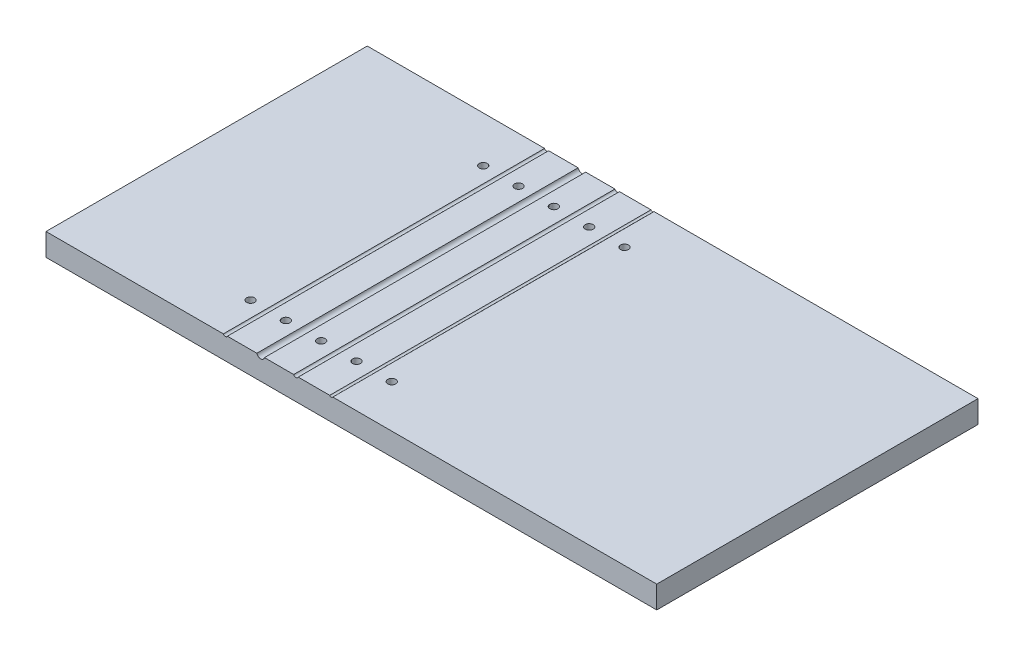
ISO-10303-21;
HEADER;
FILE_DESCRIPTION(('STEP AP214'),'2;1');
FILE_NAME('part.step','',(''),(''),'','','');
FILE_SCHEMA(('AUTOMOTIVE_DESIGN { 1 0 10303 214 1 1 1 1 }'));
ENDSEC;
DATA;
#1=APPLICATION_CONTEXT('core data for automotive mechanical design processes');
#2=APPLICATION_PROTOCOL_DEFINITION('international standard','automotive_design',2000,#1);
#3=PRODUCT_CONTEXT('',#1,'mechanical');
#4=PRODUCT('Part','Part','',(#3));
#5=PRODUCT_RELATED_PRODUCT_CATEGORY('part','',(#4));
#6=PRODUCT_DEFINITION_FORMATION('','',#4);
#7=PRODUCT_DEFINITION_CONTEXT('part definition',#1,'design');
#8=PRODUCT_DEFINITION('design','',#6,#7);
#9=PRODUCT_DEFINITION_SHAPE('','',#8);
#10=(LENGTH_UNIT() NAMED_UNIT(*) SI_UNIT(.MILLI.,.METRE.));
#11=(NAMED_UNIT(*) PLANE_ANGLE_UNIT() SI_UNIT($,.RADIAN.));
#12=(NAMED_UNIT(*) SI_UNIT($,.STERADIAN.) SOLID_ANGLE_UNIT());
#13=UNCERTAINTY_MEASURE_WITH_UNIT(LENGTH_MEASURE(1.E-05),#10,'distance_accuracy_value','');
#14=(GEOMETRIC_REPRESENTATION_CONTEXT(3) GLOBAL_UNCERTAINTY_ASSIGNED_CONTEXT((#13)) GLOBAL_UNIT_ASSIGNED_CONTEXT((#10,
#11,#12)) REPRESENTATION_CONTEXT('',''));
#15=CARTESIAN_POINT('',(0.,0.,0.));
#16=DIRECTION('',(0.,0.,1.));
#17=DIRECTION('',(1.,0.,0.));
#18=AXIS2_PLACEMENT_3D('',#15,#16,#17);
#19=CARTESIAN_POINT('',(0.,6.35,0.));
#20=DIRECTION('',(0.,1.,0.));
#21=DIRECTION('',(0.,0.,1.));
#22=AXIS2_PLACEMENT_3D('',#19,#20,#21);
#23=PLANE('',#22);
#24=CARTESIAN_POINT('',(69.420618556701,6.35,-72.4912460309142));
#25=DIRECTION('',(0.,1.,0.));
#26=DIRECTION('',(0.,0.,1.));
#27=AXIS2_PLACEMENT_3D('',#24,#25,#26);
#28=CIRCLE('',#27,1.1303);
#29=CARTESIAN_POINT('',(69.420618556701,6.35,-71.3609460309142));
#30=VERTEX_POINT('',#29);
#31=EDGE_CURVE('E303',#30,#30,#28,.T.);
#32=ORIENTED_EDGE('',*,*,#31,.F.);
#33=EDGE_LOOP('',(#32));
#34=FACE_BOUND('',#33,.T.);
#35=CARTESIAN_POINT('',(69.420618556701,6.35,-6.57431660018482));
#36=DIRECTION('',(0.,1.,0.));
#37=DIRECTION('',(0.,0.,1.));
#38=AXIS2_PLACEMENT_3D('',#35,#36,#37);
#39=CIRCLE('',#38,1.1303);
#40=CARTESIAN_POINT('',(69.420618556701,6.35,-5.44401660018481));
#41=VERTEX_POINT('',#40);
#42=EDGE_CURVE('E315',#41,#41,#39,.T.);
#43=ORIENTED_EDGE('',*,*,#42,.F.);
#44=EDGE_LOOP('',(#43));
#45=FACE_BOUND('',#44,.T.);
#46=DIRECTION('',(0.,0.,1.));
#47=VECTOR('',#46,1.);
#48=CARTESIAN_POINT('',(73.9876058548088,6.35,-85.433676975945));
#49=LINE('',#48,#47);
#50=CARTESIAN_POINT('',(73.9876058548088,6.35,-85.433676975945));
#51=VERTEX_POINT('',#50);
#52=CARTESIAN_POINT('',(73.9876058548088,6.35,5.56632302405498));
#53=VERTEX_POINT('',#52);
#54=EDGE_CURVE('E11',#51,#53,#49,.T.);
#55=ORIENTED_EDGE('',*,*,#54,.F.);
#56=DIRECTION('',(-1.,0.,0.));
#57=VECTOR('',#56,1.);
#58=CARTESIAN_POINT('',(-6.37938144329898,6.35,-85.433676975945));
#59=LINE('',#58,#57);
#60=CARTESIAN_POINT('',(65.0592277016402,6.35,-85.433676975945));
#61=VERTEX_POINT('',#60);
#62=EDGE_CURVE('E155',#51,#61,#59,.T.);
#63=ORIENTED_EDGE('',*,*,#62,.T.);
#64=DIRECTION('',(0.,0.,1.));
#65=VECTOR('',#64,1.);
#66=CARTESIAN_POINT('',(65.0592277016402,6.35,-85.433676975945));
#67=LINE('',#66,#65);
#68=CARTESIAN_POINT('',(65.0592277016402,6.35,5.56632302405498));
#69=VERTEX_POINT('',#68);
#70=EDGE_CURVE('E137',#69,#61,#67,.F.);
#71=ORIENTED_EDGE('',*,*,#70,.F.);
#72=DIRECTION('',(1.,0.,0.));
#73=VECTOR('',#72,1.);
#74=CARTESIAN_POINT('',(-6.37938144329897,6.35,5.56632302405498));
#75=LINE('',#74,#73);
#76=EDGE_CURVE('E132',#69,#53,#75,.T.);
#77=ORIENTED_EDGE('',*,*,#76,.T.);
#78=EDGE_LOOP('',(#55,#63,#71,#77));
#79=FACE_BOUND('',#78,.T.);
#80=ADVANCED_FACE('F35',(#34,#45,#79),#23,.T.);
#81=CARTESIAN_POINT('',(59.420618556701,6.35,-72.4912460309142));
#82=DIRECTION('',(0.,1.,0.));
#83=DIRECTION('',(0.,0.,1.));
#84=AXIS2_PLACEMENT_3D('',#81,#82,#83);
#85=CIRCLE('',#84,1.1303);
#86=CARTESIAN_POINT('',(59.420618556701,6.35,-71.3609460309142));
#87=VERTEX_POINT('',#86);
#88=EDGE_CURVE('E533',#87,#87,#85,.T.);
#89=ORIENTED_EDGE('',*,*,#88,.F.);
#90=EDGE_LOOP('',(#89));
#91=FACE_BOUND('',#90,.T.);
#92=CARTESIAN_POINT('',(59.420618556701,6.35,-6.57431660018482));
#93=DIRECTION('',(0.,1.,0.));
#94=DIRECTION('',(0.,0.,1.));
#95=AXIS2_PLACEMENT_3D('',#92,#93,#94);
#96=CIRCLE('',#95,1.1303);
#97=CARTESIAN_POINT('',(59.420618556701,6.35,-5.44401660018482));
#98=VERTEX_POINT('',#97);
#99=EDGE_CURVE('E291',#98,#98,#96,.T.);
#100=ORIENTED_EDGE('',*,*,#99,.F.);
#101=EDGE_LOOP('',(#100));
#102=FACE_BOUND('',#101,.T.);
#103=DIRECTION('',(0.,0.,1.));
#104=VECTOR('',#103,1.);
#105=CARTESIAN_POINT('',(63.7820094117618,6.35,-85.433676975945));
#106=LINE('',#105,#104);
#107=CARTESIAN_POINT('',(63.7820094117618,6.35,-85.433676975945));
#108=VERTEX_POINT('',#107);
#109=CARTESIAN_POINT('',(63.7820094117618,6.35,5.56632302405498));
#110=VERTEX_POINT('',#109);
#111=EDGE_CURVE('E188',#108,#110,#106,.T.);
#112=ORIENTED_EDGE('',*,*,#111,.F.);
#113=CARTESIAN_POINT('',(55.4918328209825,6.35,-85.433676975945));
#114=VERTEX_POINT('',#113);
#115=EDGE_CURVE('E216',#108,#114,#59,.T.);
#116=ORIENTED_EDGE('',*,*,#115,.T.);
#117=DIRECTION('',(0.,0.,1.));
#118=VECTOR('',#117,1.);
#119=CARTESIAN_POINT('',(55.4918328209825,6.35,-85.433676975945));
#120=LINE('',#119,#118);
#121=CARTESIAN_POINT('',(55.4918328209825,6.35,5.56632302405498));
#122=VERTEX_POINT('',#121);
#123=EDGE_CURVE('E182',#122,#114,#120,.F.);
#124=ORIENTED_EDGE('',*,*,#123,.F.);
#125=EDGE_CURVE('E138',#122,#110,#75,.T.);
#126=ORIENTED_EDGE('',*,*,#125,.T.);
#127=EDGE_LOOP('',(#112,#116,#124,#126));
#128=FACE_BOUND('',#127,.T.);
#129=ADVANCED_FACE('F245',(#91,#102,#128),#23,.T.);
#130=CARTESIAN_POINT('',(49.420618556701,6.35,-72.4912460309142));
#131=DIRECTION('',(0.,1.,0.));
#132=DIRECTION('',(0.,0.,1.));
#133=AXIS2_PLACEMENT_3D('',#130,#131,#132);
#134=CIRCLE('',#133,1.1303);
#135=CARTESIAN_POINT('',(49.420618556701,6.35,-71.3609460309142));
#136=VERTEX_POINT('',#135);
#137=EDGE_CURVE('E541',#136,#136,#134,.T.);
#138=ORIENTED_EDGE('',*,*,#137,.F.);
#139=EDGE_LOOP('',(#138));
#140=FACE_BOUND('',#139,.T.);
#141=CARTESIAN_POINT('',(49.420618556701,6.35,-6.57431660018482));
#142=DIRECTION('',(0.,1.,0.));
#143=DIRECTION('',(0.,0.,1.));
#144=AXIS2_PLACEMENT_3D('',#141,#142,#143);
#145=CIRCLE('',#144,1.1303);
#146=CARTESIAN_POINT('',(49.420618556701,6.35,-5.44401660018481));
#147=VERTEX_POINT('',#146);
#148=EDGE_CURVE('E294',#147,#147,#145,.T.);
#149=ORIENTED_EDGE('',*,*,#148,.F.);
#150=EDGE_LOOP('',(#149));
#151=FACE_BOUND('',#150,.T.);
#152=DIRECTION('',(0.,0.,1.));
#153=VECTOR('',#152,1.);
#154=CARTESIAN_POINT('',(53.3494042924196,6.35,-85.433676975945));
#155=LINE('',#154,#153);
#156=CARTESIAN_POINT('',(53.3494042924196,6.35,-85.433676975945));
#157=VERTEX_POINT('',#156);
#158=CARTESIAN_POINT('',(53.3494042924196,6.35,5.56632302405498));
#159=VERTEX_POINT('',#158);
#160=EDGE_CURVE('E185',#157,#159,#155,.T.);
#161=ORIENTED_EDGE('',*,*,#160,.F.);
#162=CARTESIAN_POINT('',(44.9904933587409,6.35,-85.433676975945));
#163=VERTEX_POINT('',#162);
#164=EDGE_CURVE('E215',#157,#163,#59,.T.);
#165=ORIENTED_EDGE('',*,*,#164,.T.);
#166=DIRECTION('',(0.,0.,1.));
#167=VECTOR('',#166,1.);
#168=CARTESIAN_POINT('',(44.9904933587409,6.35,-85.433676975945));
#169=LINE('',#168,#167);
#170=CARTESIAN_POINT('',(44.9904933587409,6.35,5.56632302405498));
#171=VERTEX_POINT('',#170);
#172=EDGE_CURVE('E177',#171,#163,#169,.F.);
#173=ORIENTED_EDGE('',*,*,#172,.F.);
#174=EDGE_CURVE('E141',#171,#159,#75,.T.);
#175=ORIENTED_EDGE('',*,*,#174,.T.);
#176=EDGE_LOOP('',(#161,#165,#173,#175));
#177=FACE_BOUND('',#176,.T.);
#178=ADVANCED_FACE('F240',(#140,#151,#177),#23,.T.);
#179=CARTESIAN_POINT('',(39.420618556701,6.35,-72.4912460309142));
#180=DIRECTION('',(0.,1.,0.));
#181=DIRECTION('',(0.,0.,1.));
#182=AXIS2_PLACEMENT_3D('',#179,#180,#181);
#183=CIRCLE('',#182,1.1303);
#184=CARTESIAN_POINT('',(39.420618556701,6.35,-71.3609460309142));
#185=VERTEX_POINT('',#184);
#186=EDGE_CURVE('E282',#185,#185,#183,.T.);
#187=ORIENTED_EDGE('',*,*,#186,.F.);
#188=EDGE_LOOP('',(#187));
#189=FACE_BOUND('',#188,.T.);
#190=CARTESIAN_POINT('',(39.420618556701,6.35,-6.57431660018482));
#191=DIRECTION('',(0.,1.,0.));
#192=DIRECTION('',(0.,0.,1.));
#193=AXIS2_PLACEMENT_3D('',#190,#191,#192);
#194=CIRCLE('',#193,1.1303);
#195=CARTESIAN_POINT('',(39.420618556701,6.35,-5.44401660018481));
#196=VERTEX_POINT('',#195);
#197=EDGE_CURVE('E285',#196,#196,#194,.T.);
#198=ORIENTED_EDGE('',*,*,#197,.F.);
#199=EDGE_LOOP('',(#198));
#200=FACE_BOUND('',#199,.T.);
#201=DIRECTION('',(0.,0.,1.));
#202=VECTOR('',#201,1.);
#203=CARTESIAN_POINT('',(43.8507437546611,6.35,-85.433676975945));
#204=LINE('',#203,#202);
#205=CARTESIAN_POINT('',(43.8507437546611,6.35,-85.433676975945));
#206=VERTEX_POINT('',#205);
#207=CARTESIAN_POINT('',(43.8507437546611,6.35,5.56632302405498));
#208=VERTEX_POINT('',#207);
#209=EDGE_CURVE('E180',#206,#208,#204,.T.);
#210=ORIENTED_EDGE('',*,*,#209,.F.);
#211=CARTESIAN_POINT('',(-6.37938144329898,6.35,-85.433676975945));
#212=VERTEX_POINT('',#211);
#213=EDGE_CURVE('E150',#206,#212,#59,.T.);
#214=ORIENTED_EDGE('',*,*,#213,.T.);
#215=DIRECTION('',(0.,0.,1.));
#216=VECTOR('',#215,1.);
#217=CARTESIAN_POINT('',(-6.37938144329898,6.35,-85.433676975945));
#218=LINE('',#217,#216);
#219=CARTESIAN_POINT('',(-6.37938144329897,6.35,5.56632302405498));
#220=VERTEX_POINT('',#219);
#221=EDGE_CURVE('E142',#212,#220,#218,.T.);
#222=ORIENTED_EDGE('',*,*,#221,.T.);
#223=EDGE_CURVE('E143',#220,#208,#75,.T.);
#224=ORIENTED_EDGE('',*,*,#223,.T.);
#225=EDGE_LOOP('',(#210,#214,#222,#224));
#226=FACE_BOUND('',#225,.T.);
#227=ADVANCED_FACE('F253',(#189,#200,#226),#23,.T.);
#228=CARTESIAN_POINT('',(-6.37938144329898,6.35,-85.433676975945));
#229=DIRECTION('',(1.,0.,0.));
#230=DIRECTION('',(0.,0.,-1.));
#231=AXIS2_PLACEMENT_3D('',#228,#229,#230);
#232=PLANE('',#231);
#233=DIRECTION('',(0.,0.,1.));
#234=VECTOR('',#233,1.);
#235=CARTESIAN_POINT('',(-6.37938144329898,0.,-85.433676975945));
#236=LINE('',#235,#234);
#237=CARTESIAN_POINT('',(-6.37938144329898,0.,-85.433676975945));
#238=VERTEX_POINT('',#237);
#239=CARTESIAN_POINT('',(-6.37938144329897,0.,5.56632302405498));
#240=VERTEX_POINT('',#239);
#241=EDGE_CURVE('E156',#238,#240,#236,.T.);
#242=ORIENTED_EDGE('',*,*,#241,.T.);
#243=DIRECTION('',(0.,-1.,0.));
#244=VECTOR('',#243,1.);
#245=CARTESIAN_POINT('',(-6.37938144329897,6.35,5.56632302405498));
#246=LINE('',#245,#244);
#247=EDGE_CURVE('E174',#220,#240,#246,.T.);
#248=ORIENTED_EDGE('',*,*,#247,.F.);
#249=ORIENTED_EDGE('',*,*,#221,.F.);
#250=DIRECTION('',(0.,-1.,0.));
#251=VECTOR('',#250,1.);
#252=CARTESIAN_POINT('',(-6.37938144329898,6.35,-85.433676975945));
#253=LINE('',#252,#251);
#254=EDGE_CURVE('E154',#212,#238,#253,.T.);
#255=ORIENTED_EDGE('',*,*,#254,.T.);
#256=EDGE_LOOP('',(#242,#248,#249,#255));
#257=FACE_BOUND('',#256,.T.);
#258=ADVANCED_FACE('F37',(#257),#232,.F.);
#259=CARTESIAN_POINT('',(-6.37938144329897,6.35,5.56632302405498));
#260=DIRECTION('',(0.,0.,-1.));
#261=DIRECTION('',(-1.,0.,0.));
#262=AXIS2_PLACEMENT_3D('',#259,#260,#261);
#263=PLANE('',#262);
#264=CARTESIAN_POINT('',(74.8536312585933,6.35,5.56632302405498));
#265=VERTEX_POINT('',#264);
#266=CARTESIAN_POINT('',(166.620618556701,6.35,5.56632302405498));
#267=VERTEX_POINT('',#266);
#268=EDGE_CURVE('E134',#265,#267,#75,.T.);
#269=ORIENTED_EDGE('',*,*,#268,.F.);
#270=CARTESIAN_POINT('',(74.420618556701,6.6,5.56632302405498));
#271=DIRECTION('',(0.,0.,1.));
#272=DIRECTION('',(1.,0.,0.));
#273=AXIS2_PLACEMENT_3D('',#270,#271,#272);
#274=CIRCLE('',#273,0.499999999999999);
#275=EDGE_CURVE('E49',#53,#265,#274,.T.);
#276=ORIENTED_EDGE('',*,*,#275,.F.);
#277=ORIENTED_EDGE('',*,*,#76,.F.);
#278=CARTESIAN_POINT('',(64.420618556701,6.6,5.56632302405498));
#279=DIRECTION('',(0.,0.,1.));
#280=DIRECTION('',(1.,0.,0.));
#281=AXIS2_PLACEMENT_3D('',#278,#279,#280);
#282=CIRCLE('',#281,0.685799999999995);
#283=EDGE_CURVE('E57',#110,#69,#282,.T.);
#284=ORIENTED_EDGE('',*,*,#283,.F.);
#285=ORIENTED_EDGE('',*,*,#125,.F.);
#286=CARTESIAN_POINT('',(54.420618556701,6.6,5.56632302405498));
#287=DIRECTION('',(0.,0.,1.));
#288=DIRECTION('',(1.,0.,0.));
#289=AXIS2_PLACEMENT_3D('',#286,#287,#288);
#290=CIRCLE('',#289,1.1);
#291=EDGE_CURVE('E227',#159,#122,#290,.T.);
#292=ORIENTED_EDGE('',*,*,#291,.F.);
#293=ORIENTED_EDGE('',*,*,#174,.F.);
#294=CARTESIAN_POINT('',(44.420618556701,6.6,5.56632302405498));
#295=DIRECTION('',(0.,0.,1.));
#296=DIRECTION('',(1.,0.,0.));
#297=AXIS2_PLACEMENT_3D('',#294,#295,#296);
#298=CIRCLE('',#297,0.622300000000001);
#299=EDGE_CURVE('E233',#208,#171,#298,.T.);
#300=ORIENTED_EDGE('',*,*,#299,.F.);
#301=ORIENTED_EDGE('',*,*,#223,.F.);
#302=ORIENTED_EDGE('',*,*,#247,.T.);
#303=DIRECTION('',(1.,0.,0.));
#304=VECTOR('',#303,1.);
#305=CARTESIAN_POINT('',(-6.37938144329897,0.,5.56632302405498));
#306=LINE('',#305,#304);
#307=CARTESIAN_POINT('',(166.620618556701,0.,5.56632302405498));
#308=VERTEX_POINT('',#307);
#309=EDGE_CURVE('E159',#240,#308,#306,.T.);
#310=ORIENTED_EDGE('',*,*,#309,.T.);
#311=DIRECTION('',(0.,-1.,0.));
#312=VECTOR('',#311,1.);
#313=CARTESIAN_POINT('',(166.620618556701,6.35,5.56632302405498));
#314=LINE('',#313,#312);
#315=EDGE_CURVE('E171',#267,#308,#314,.T.);
#316=ORIENTED_EDGE('',*,*,#315,.F.);
#317=EDGE_LOOP('',(#269,#276,#277,#284,#285,#292,#293,#300,#301,#302,#310,#316));
#318=FACE_BOUND('',#317,.T.);
#319=ADVANCED_FACE('F131',(#318),#263,.F.);
#320=CARTESIAN_POINT('',(166.620618556701,6.35,-85.433676975945));
#321=DIRECTION('',(-1.,0.,0.));
#322=DIRECTION('',(0.,0.,1.));
#323=AXIS2_PLACEMENT_3D('',#320,#321,#322);
#324=PLANE('',#323);
#325=DIRECTION('',(0.,0.,-1.));
#326=VECTOR('',#325,1.);
#327=CARTESIAN_POINT('',(166.620618556701,0.,-85.433676975945));
#328=LINE('',#327,#326);
#329=CARTESIAN_POINT('',(166.620618556701,0.,-85.433676975945));
#330=VERTEX_POINT('',#329);
#331=EDGE_CURVE('E162',#308,#330,#328,.T.);
#332=ORIENTED_EDGE('',*,*,#331,.T.);
#333=DIRECTION('',(0.,-1.,0.));
#334=VECTOR('',#333,1.);
#335=CARTESIAN_POINT('',(166.620618556701,6.35,-85.433676975945));
#336=LINE('',#335,#334);
#337=CARTESIAN_POINT('',(166.620618556701,6.35,-85.433676975945));
#338=VERTEX_POINT('',#337);
#339=EDGE_CURVE('E168',#338,#330,#336,.T.);
#340=ORIENTED_EDGE('',*,*,#339,.F.);
#341=DIRECTION('',(0.,0.,-1.));
#342=VECTOR('',#341,1.);
#343=CARTESIAN_POINT('',(166.620618556701,6.35,-85.433676975945));
#344=LINE('',#343,#342);
#345=EDGE_CURVE('E147',#267,#338,#344,.T.);
#346=ORIENTED_EDGE('',*,*,#345,.F.);
#347=ORIENTED_EDGE('',*,*,#315,.T.);
#348=EDGE_LOOP('',(#332,#340,#346,#347));
#349=FACE_BOUND('',#348,.T.);
#350=ADVANCED_FACE('F199',(#349),#324,.F.);
#351=CARTESIAN_POINT('',(-6.37938144329898,6.35,-85.433676975945));
#352=DIRECTION('',(0.,0.,1.));
#353=DIRECTION('',(1.,0.,0.));
#354=AXIS2_PLACEMENT_3D('',#351,#352,#353);
#355=PLANE('',#354);
#356=ORIENTED_EDGE('',*,*,#62,.F.);
#357=CARTESIAN_POINT('',(74.420618556701,6.6,-85.433676975945));
#358=DIRECTION('',(0.,0.,1.));
#359=DIRECTION('',(1.,0.,0.));
#360=AXIS2_PLACEMENT_3D('',#357,#358,#359);
#361=CIRCLE('',#360,0.499999999999999);
#362=CARTESIAN_POINT('',(74.8536312585933,6.35,-85.433676975945));
#363=VERTEX_POINT('',#362);
#364=EDGE_CURVE('E124',#51,#363,#361,.T.);
#365=ORIENTED_EDGE('',*,*,#364,.T.);
#366=EDGE_CURVE('E151',#338,#363,#59,.T.);
#367=ORIENTED_EDGE('',*,*,#366,.F.);
#368=ORIENTED_EDGE('',*,*,#339,.T.);
#369=DIRECTION('',(-1.,0.,0.));
#370=VECTOR('',#369,1.);
#371=CARTESIAN_POINT('',(-6.37938144329898,0.,-85.433676975945));
#372=LINE('',#371,#370);
#373=EDGE_CURVE('E164',#330,#238,#372,.T.);
#374=ORIENTED_EDGE('',*,*,#373,.T.);
#375=ORIENTED_EDGE('',*,*,#254,.F.);
#376=ORIENTED_EDGE('',*,*,#213,.F.);
#377=CARTESIAN_POINT('',(44.420618556701,6.6,-85.433676975945));
#378=DIRECTION('',(0.,0.,1.));
#379=DIRECTION('',(1.,0.,0.));
#380=AXIS2_PLACEMENT_3D('',#377,#378,#379);
#381=CIRCLE('',#380,0.622300000000001);
#382=EDGE_CURVE('E160',#206,#163,#381,.T.);
#383=ORIENTED_EDGE('',*,*,#382,.T.);
#384=ORIENTED_EDGE('',*,*,#164,.F.);
#385=CARTESIAN_POINT('',(54.420618556701,6.6,-85.433676975945));
#386=DIRECTION('',(0.,0.,1.));
#387=DIRECTION('',(1.,0.,0.));
#388=AXIS2_PLACEMENT_3D('',#385,#386,#387);
#389=CIRCLE('',#388,1.1);
#390=EDGE_CURVE('E229',#157,#114,#389,.T.);
#391=ORIENTED_EDGE('',*,*,#390,.T.);
#392=ORIENTED_EDGE('',*,*,#115,.F.);
#393=CARTESIAN_POINT('',(64.420618556701,6.6,-85.433676975945));
#394=DIRECTION('',(0.,0.,1.));
#395=DIRECTION('',(1.,0.,0.));
#396=AXIS2_PLACEMENT_3D('',#393,#394,#395);
#397=CIRCLE('',#396,0.685799999999995);
#398=EDGE_CURVE('E225',#108,#61,#397,.T.);
#399=ORIENTED_EDGE('',*,*,#398,.T.);
#400=EDGE_LOOP('',(#356,#365,#367,#368,#374,#375,#376,#383,#384,#391,#392,#399));
#401=FACE_BOUND('',#400,.T.);
#402=ADVANCED_FACE('F192',(#401),#355,.F.);
#403=CARTESIAN_POINT('',(79.420618556701,6.35,-72.4912460309142));
#404=DIRECTION('',(0.,1.,0.));
#405=DIRECTION('',(0.,0.,1.));
#406=AXIS2_PLACEMENT_3D('',#403,#404,#405);
#407=CIRCLE('',#406,1.1303);
#408=CARTESIAN_POINT('',(79.420618556701,6.35,-71.3609460309142));
#409=VERTEX_POINT('',#408);
#410=EDGE_CURVE('E309',#409,#409,#407,.T.);
#411=ORIENTED_EDGE('',*,*,#410,.F.);
#412=EDGE_LOOP('',(#411));
#413=FACE_BOUND('',#412,.T.);
#414=CARTESIAN_POINT('',(79.420618556701,6.35,-6.57431660018482));
#415=DIRECTION('',(0.,1.,0.));
#416=DIRECTION('',(0.,0.,1.));
#417=AXIS2_PLACEMENT_3D('',#414,#415,#416);
#418=CIRCLE('',#417,1.1303);
#419=CARTESIAN_POINT('',(79.420618556701,6.35,-5.44401660018481));
#420=VERTEX_POINT('',#419);
#421=EDGE_CURVE('E321',#420,#420,#418,.T.);
#422=ORIENTED_EDGE('',*,*,#421,.F.);
#423=EDGE_LOOP('',(#422));
#424=FACE_BOUND('',#423,.T.);
#425=DIRECTION('',(0.,0.,1.));
#426=VECTOR('',#425,1.);
#427=CARTESIAN_POINT('',(74.8536312585933,6.35,-85.433676975945));
#428=LINE('',#427,#426);
#429=EDGE_CURVE('E43',#265,#363,#428,.F.);
#430=ORIENTED_EDGE('',*,*,#429,.F.);
#431=ORIENTED_EDGE('',*,*,#268,.T.);
#432=ORIENTED_EDGE('',*,*,#345,.T.);
#433=ORIENTED_EDGE('',*,*,#366,.T.);
#434=EDGE_LOOP('',(#430,#431,#432,#433));
#435=FACE_BOUND('',#434,.T.);
#436=ADVANCED_FACE('F195',(#413,#424,#435),#23,.T.);
#437=CARTESIAN_POINT('',(0.,0.,0.));
#438=DIRECTION('',(0.,1.,0.));
#439=DIRECTION('',(0.,0.,1.));
#440=AXIS2_PLACEMENT_3D('',#437,#438,#439);
#441=PLANE('',#440);
#442=CARTESIAN_POINT('',(39.420618556701,0.,-72.4912460309142));
#443=DIRECTION('',(0.,1.,0.));
#444=DIRECTION('',(0.,0.,1.));
#445=AXIS2_PLACEMENT_3D('',#442,#443,#444);
#446=CIRCLE('',#445,1.1303);
#447=CARTESIAN_POINT('',(39.420618556701,0.,-71.3609460309142));
#448=VERTEX_POINT('',#447);
#449=EDGE_CURVE('E531',#448,#448,#446,.T.);
#450=ORIENTED_EDGE('',*,*,#449,.T.);
#451=EDGE_LOOP('',(#450));
#452=FACE_BOUND('',#451,.T.);
#453=CARTESIAN_POINT('',(59.420618556701,0.,-72.4912460309142));
#454=DIRECTION('',(0.,1.,0.));
#455=DIRECTION('',(0.,0.,1.));
#456=AXIS2_PLACEMENT_3D('',#453,#454,#455);
#457=CIRCLE('',#456,1.1303);
#458=CARTESIAN_POINT('',(59.420618556701,0.,-71.3609460309142));
#459=VERTEX_POINT('',#458);
#460=EDGE_CURVE('E538',#459,#459,#457,.T.);
#461=ORIENTED_EDGE('',*,*,#460,.T.);
#462=EDGE_LOOP('',(#461));
#463=FACE_BOUND('',#462,.T.);
#464=CARTESIAN_POINT('',(49.420618556701,0.,-72.4912460309142));
#465=DIRECTION('',(0.,1.,0.));
#466=DIRECTION('',(0.,0.,1.));
#467=AXIS2_PLACEMENT_3D('',#464,#465,#466);
#468=CIRCLE('',#467,1.1303);
#469=CARTESIAN_POINT('',(49.420618556701,0.,-71.3609460309142));
#470=VERTEX_POINT('',#469);
#471=EDGE_CURVE('E544',#470,#470,#468,.T.);
#472=ORIENTED_EDGE('',*,*,#471,.T.);
#473=EDGE_LOOP('',(#472));
#474=FACE_BOUND('',#473,.T.);
#475=CARTESIAN_POINT('',(49.420618556701,0.,-6.57431660018482));
#476=DIRECTION('',(0.,1.,0.));
#477=DIRECTION('',(0.,0.,1.));
#478=AXIS2_PLACEMENT_3D('',#475,#476,#477);
#479=CIRCLE('',#478,1.1303);
#480=CARTESIAN_POINT('',(49.420618556701,0.,-5.44401660018481));
#481=VERTEX_POINT('',#480);
#482=EDGE_CURVE('E288',#481,#481,#479,.T.);
#483=ORIENTED_EDGE('',*,*,#482,.T.);
#484=EDGE_LOOP('',(#483));
#485=FACE_BOUND('',#484,.T.);
#486=CARTESIAN_POINT('',(39.420618556701,0.,-6.57431660018482));
#487=DIRECTION('',(0.,1.,0.));
#488=DIRECTION('',(0.,0.,1.));
#489=AXIS2_PLACEMENT_3D('',#486,#487,#488);
#490=CIRCLE('',#489,1.1303);
#491=CARTESIAN_POINT('',(39.420618556701,0.,-5.44401660018481));
#492=VERTEX_POINT('',#491);
#493=EDGE_CURVE('E287',#492,#492,#490,.T.);
#494=ORIENTED_EDGE('',*,*,#493,.T.);
#495=EDGE_LOOP('',(#494));
#496=FACE_BOUND('',#495,.T.);
#497=CARTESIAN_POINT('',(59.420618556701,0.,-6.57431660018482));
#498=DIRECTION('',(0.,1.,0.));
#499=DIRECTION('',(0.,0.,1.));
#500=AXIS2_PLACEMENT_3D('',#497,#498,#499);
#501=CIRCLE('',#500,1.1303);
#502=CARTESIAN_POINT('',(59.420618556701,0.,-5.44401660018482));
#503=VERTEX_POINT('',#502);
#504=EDGE_CURVE('E300',#503,#503,#501,.T.);
#505=ORIENTED_EDGE('',*,*,#504,.T.);
#506=EDGE_LOOP('',(#505));
#507=FACE_BOUND('',#506,.T.);
#508=CARTESIAN_POINT('',(69.420618556701,0.,-72.4912460309142));
#509=DIRECTION('',(0.,1.,0.));
#510=DIRECTION('',(0.,0.,1.));
#511=AXIS2_PLACEMENT_3D('',#508,#509,#510);
#512=CIRCLE('',#511,1.1303);
#513=CARTESIAN_POINT('',(69.420618556701,0.,-71.3609460309142));
#514=VERTEX_POINT('',#513);
#515=EDGE_CURVE('E306',#514,#514,#512,.T.);
#516=ORIENTED_EDGE('',*,*,#515,.T.);
#517=EDGE_LOOP('',(#516));
#518=FACE_BOUND('',#517,.T.);
#519=CARTESIAN_POINT('',(79.420618556701,0.,-72.4912460309142));
#520=DIRECTION('',(0.,1.,0.));
#521=DIRECTION('',(0.,0.,1.));
#522=AXIS2_PLACEMENT_3D('',#519,#520,#521);
#523=CIRCLE('',#522,1.1303);
#524=CARTESIAN_POINT('',(79.420618556701,0.,-71.3609460309142));
#525=VERTEX_POINT('',#524);
#526=EDGE_CURVE('E312',#525,#525,#523,.T.);
#527=ORIENTED_EDGE('',*,*,#526,.T.);
#528=EDGE_LOOP('',(#527));
#529=FACE_BOUND('',#528,.T.);
#530=CARTESIAN_POINT('',(69.420618556701,0.,-6.57431660018482));
#531=DIRECTION('',(0.,1.,0.));
#532=DIRECTION('',(0.,0.,1.));
#533=AXIS2_PLACEMENT_3D('',#530,#531,#532);
#534=CIRCLE('',#533,1.1303);
#535=CARTESIAN_POINT('',(69.420618556701,0.,-5.44401660018481));
#536=VERTEX_POINT('',#535);
#537=EDGE_CURVE('E318',#536,#536,#534,.T.);
#538=ORIENTED_EDGE('',*,*,#537,.T.);
#539=EDGE_LOOP('',(#538));
#540=FACE_BOUND('',#539,.T.);
#541=CARTESIAN_POINT('',(79.420618556701,0.,-6.57431660018482));
#542=DIRECTION('',(0.,1.,0.));
#543=DIRECTION('',(0.,0.,1.));
#544=AXIS2_PLACEMENT_3D('',#541,#542,#543);
#545=CIRCLE('',#544,1.1303);
#546=CARTESIAN_POINT('',(79.420618556701,0.,-5.44401660018481));
#547=VERTEX_POINT('',#546);
#548=EDGE_CURVE('E135',#547,#547,#545,.T.);
#549=ORIENTED_EDGE('',*,*,#548,.T.);
#550=EDGE_LOOP('',(#549));
#551=FACE_BOUND('',#550,.T.);
#552=ORIENTED_EDGE('',*,*,#241,.F.);
#553=ORIENTED_EDGE('',*,*,#373,.F.);
#554=ORIENTED_EDGE('',*,*,#331,.F.);
#555=ORIENTED_EDGE('',*,*,#309,.F.);
#556=EDGE_LOOP('',(#552,#553,#554,#555));
#557=FACE_BOUND('',#556,.T.);
#558=ADVANCED_FACE('F205',(#452,#463,#474,#485,#496,#507,#518,#529,#540,#551,#557),#441,.F.);
#559=CARTESIAN_POINT('',(44.420618556701,6.6,-85.433676975945));
#560=DIRECTION('',(0.,0.,1.));
#561=DIRECTION('',(1.,0.,0.));
#562=AXIS2_PLACEMENT_3D('',#559,#560,#561);
#563=CYLINDRICAL_SURFACE('',#562,0.622300000000001);
#564=ORIENTED_EDGE('',*,*,#209,.T.);
#565=ORIENTED_EDGE('',*,*,#299,.T.);
#566=ORIENTED_EDGE('',*,*,#172,.T.);
#567=ORIENTED_EDGE('',*,*,#382,.F.);
#568=EDGE_LOOP('',(#564,#565,#566,#567));
#569=FACE_BOUND('',#568,.T.);
#570=ADVANCED_FACE('F237',(#569),#563,.F.);
#571=CARTESIAN_POINT('',(54.420618556701,6.6,-85.433676975945));
#572=DIRECTION('',(0.,0.,1.));
#573=DIRECTION('',(1.,0.,0.));
#574=AXIS2_PLACEMENT_3D('',#571,#572,#573);
#575=CYLINDRICAL_SURFACE('',#574,1.1);
#576=ORIENTED_EDGE('',*,*,#160,.T.);
#577=ORIENTED_EDGE('',*,*,#291,.T.);
#578=ORIENTED_EDGE('',*,*,#123,.T.);
#579=ORIENTED_EDGE('',*,*,#390,.F.);
#580=EDGE_LOOP('',(#576,#577,#578,#579));
#581=FACE_BOUND('',#580,.T.);
#582=ADVANCED_FACE('F244',(#581),#575,.F.);
#583=CARTESIAN_POINT('',(64.420618556701,6.6,-85.433676975945));
#584=DIRECTION('',(0.,0.,1.));
#585=DIRECTION('',(1.,0.,0.));
#586=AXIS2_PLACEMENT_3D('',#583,#584,#585);
#587=CYLINDRICAL_SURFACE('',#586,0.685799999999995);
#588=ORIENTED_EDGE('',*,*,#111,.T.);
#589=ORIENTED_EDGE('',*,*,#283,.T.);
#590=ORIENTED_EDGE('',*,*,#70,.T.);
#591=ORIENTED_EDGE('',*,*,#398,.F.);
#592=EDGE_LOOP('',(#588,#589,#590,#591));
#593=FACE_BOUND('',#592,.T.);
#594=ADVANCED_FACE('F224',(#593),#587,.F.);
#595=CARTESIAN_POINT('',(74.420618556701,6.6,-85.433676975945));
#596=DIRECTION('',(0.,0.,1.));
#597=DIRECTION('',(1.,0.,0.));
#598=AXIS2_PLACEMENT_3D('',#595,#596,#597);
#599=CYLINDRICAL_SURFACE('',#598,0.499999999999999);
#600=ORIENTED_EDGE('',*,*,#54,.T.);
#601=ORIENTED_EDGE('',*,*,#275,.T.);
#602=ORIENTED_EDGE('',*,*,#429,.T.);
#603=ORIENTED_EDGE('',*,*,#364,.F.);
#604=EDGE_LOOP('',(#600,#601,#602,#603));
#605=FACE_BOUND('',#604,.T.);
#606=ADVANCED_FACE('F122',(#605),#599,.F.);
#607=CARTESIAN_POINT('',(79.420618556701,6.35,-6.57431660018482));
#608=DIRECTION('',(0.,1.,0.));
#609=DIRECTION('',(0.,0.,1.));
#610=AXIS2_PLACEMENT_3D('',#607,#608,#609);
#611=CYLINDRICAL_SURFACE('',#610,1.1303);
#612=ORIENTED_EDGE('',*,*,#548,.F.);
#613=EDGE_LOOP('',(#612));
#614=FACE_BOUND('',#613,.T.);
#615=ORIENTED_EDGE('',*,*,#421,.T.);
#616=EDGE_LOOP('',(#615));
#617=FACE_BOUND('',#616,.T.);
#618=ADVANCED_FACE('F328',(#614,#617),#611,.F.);
#619=CARTESIAN_POINT('',(69.420618556701,6.35,-6.57431660018482));
#620=DIRECTION('',(0.,1.,0.));
#621=DIRECTION('',(0.,0.,1.));
#622=AXIS2_PLACEMENT_3D('',#619,#620,#621);
#623=CYLINDRICAL_SURFACE('',#622,1.1303);
#624=ORIENTED_EDGE('',*,*,#537,.F.);
#625=EDGE_LOOP('',(#624));
#626=FACE_BOUND('',#625,.T.);
#627=ORIENTED_EDGE('',*,*,#42,.T.);
#628=EDGE_LOOP('',(#627));
#629=FACE_BOUND('',#628,.T.);
#630=ADVANCED_FACE('F331',(#626,#629),#623,.F.);
#631=CARTESIAN_POINT('',(79.420618556701,6.35,-72.4912460309142));
#632=DIRECTION('',(0.,1.,0.));
#633=DIRECTION('',(0.,0.,1.));
#634=AXIS2_PLACEMENT_3D('',#631,#632,#633);
#635=CYLINDRICAL_SURFACE('',#634,1.1303);
#636=ORIENTED_EDGE('',*,*,#526,.F.);
#637=EDGE_LOOP('',(#636));
#638=FACE_BOUND('',#637,.T.);
#639=ORIENTED_EDGE('',*,*,#410,.T.);
#640=EDGE_LOOP('',(#639));
#641=FACE_BOUND('',#640,.T.);
#642=ADVANCED_FACE('F339',(#638,#641),#635,.F.);
#643=CARTESIAN_POINT('',(69.420618556701,6.35,-72.4912460309142));
#644=DIRECTION('',(0.,1.,0.));
#645=DIRECTION('',(0.,0.,1.));
#646=AXIS2_PLACEMENT_3D('',#643,#644,#645);
#647=CYLINDRICAL_SURFACE('',#646,1.1303);
#648=ORIENTED_EDGE('',*,*,#515,.F.);
#649=EDGE_LOOP('',(#648));
#650=FACE_BOUND('',#649,.T.);
#651=ORIENTED_EDGE('',*,*,#31,.T.);
#652=EDGE_LOOP('',(#651));
#653=FACE_BOUND('',#652,.T.);
#654=ADVANCED_FACE('F437',(#650,#653),#647,.F.);
#655=CARTESIAN_POINT('',(59.420618556701,6.35,-6.57431660018482));
#656=DIRECTION('',(0.,1.,0.));
#657=DIRECTION('',(0.,0.,1.));
#658=AXIS2_PLACEMENT_3D('',#655,#656,#657);
#659=CYLINDRICAL_SURFACE('',#658,1.1303);
#660=ORIENTED_EDGE('',*,*,#504,.F.);
#661=EDGE_LOOP('',(#660));
#662=FACE_BOUND('',#661,.T.);
#663=ORIENTED_EDGE('',*,*,#99,.T.);
#664=EDGE_LOOP('',(#663));
#665=FACE_BOUND('',#664,.T.);
#666=ADVANCED_FACE('F446',(#662,#665),#659,.F.);
#667=CARTESIAN_POINT('',(39.420618556701,6.35,-6.57431660018482));
#668=DIRECTION('',(0.,1.,0.));
#669=DIRECTION('',(0.,0.,1.));
#670=AXIS2_PLACEMENT_3D('',#667,#668,#669);
#671=CYLINDRICAL_SURFACE('',#670,1.1303);
#672=ORIENTED_EDGE('',*,*,#493,.F.);
#673=EDGE_LOOP('',(#672));
#674=FACE_BOUND('',#673,.T.);
#675=ORIENTED_EDGE('',*,*,#197,.T.);
#676=EDGE_LOOP('',(#675));
#677=FACE_BOUND('',#676,.T.);
#678=ADVANCED_FACE('F456',(#674,#677),#671,.F.);
#679=CARTESIAN_POINT('',(49.420618556701,6.35,-6.57431660018482));
#680=DIRECTION('',(0.,1.,0.));
#681=DIRECTION('',(0.,0.,1.));
#682=AXIS2_PLACEMENT_3D('',#679,#680,#681);
#683=CYLINDRICAL_SURFACE('',#682,1.1303);
#684=ORIENTED_EDGE('',*,*,#482,.F.);
#685=EDGE_LOOP('',(#684));
#686=FACE_BOUND('',#685,.T.);
#687=ORIENTED_EDGE('',*,*,#148,.T.);
#688=EDGE_LOOP('',(#687));
#689=FACE_BOUND('',#688,.T.);
#690=ADVANCED_FACE('F466',(#686,#689),#683,.F.);
#691=CARTESIAN_POINT('',(49.420618556701,6.35,-72.4912460309142));
#692=DIRECTION('',(0.,1.,0.));
#693=DIRECTION('',(0.,0.,1.));
#694=AXIS2_PLACEMENT_3D('',#691,#692,#693);
#695=CYLINDRICAL_SURFACE('',#694,1.1303);
#696=ORIENTED_EDGE('',*,*,#471,.F.);
#697=EDGE_LOOP('',(#696));
#698=FACE_BOUND('',#697,.T.);
#699=ORIENTED_EDGE('',*,*,#137,.T.);
#700=EDGE_LOOP('',(#699));
#701=FACE_BOUND('',#700,.T.);
#702=ADVANCED_FACE('F476',(#698,#701),#695,.F.);
#703=CARTESIAN_POINT('',(59.420618556701,6.35,-72.4912460309142));
#704=DIRECTION('',(0.,1.,0.));
#705=DIRECTION('',(0.,0.,1.));
#706=AXIS2_PLACEMENT_3D('',#703,#704,#705);
#707=CYLINDRICAL_SURFACE('',#706,1.1303);
#708=ORIENTED_EDGE('',*,*,#460,.F.);
#709=EDGE_LOOP('',(#708));
#710=FACE_BOUND('',#709,.T.);
#711=ORIENTED_EDGE('',*,*,#88,.T.);
#712=EDGE_LOOP('',(#711));
#713=FACE_BOUND('',#712,.T.);
#714=ADVANCED_FACE('F486',(#710,#713),#707,.F.);
#715=CARTESIAN_POINT('',(39.420618556701,6.35,-72.4912460309142));
#716=DIRECTION('',(0.,1.,0.));
#717=DIRECTION('',(0.,0.,1.));
#718=AXIS2_PLACEMENT_3D('',#715,#716,#717);
#719=CYLINDRICAL_SURFACE('',#718,1.1303);
#720=ORIENTED_EDGE('',*,*,#449,.F.);
#721=EDGE_LOOP('',(#720));
#722=FACE_BOUND('',#721,.T.);
#723=ORIENTED_EDGE('',*,*,#186,.T.);
#724=EDGE_LOOP('',(#723));
#725=FACE_BOUND('',#724,.T.);
#726=ADVANCED_FACE('F496',(#722,#725),#719,.F.);
#727=CLOSED_SHELL('',(#80,#129,#178,#227,#258,#319,#350,#402,#436,#558,#570,#582,#594,#606,#618,
#630,#642,#654,#666,#678,#690,#702,#714,#726));
#728=MANIFOLD_SOLID_BREP('B2',#727);
#729=ADVANCED_BREP_SHAPE_REPRESENTATION('',(#18,#728),#14);
#730=SHAPE_DEFINITION_REPRESENTATION(#9,#729);
ENDSEC;
END-ISO-10303-21;
